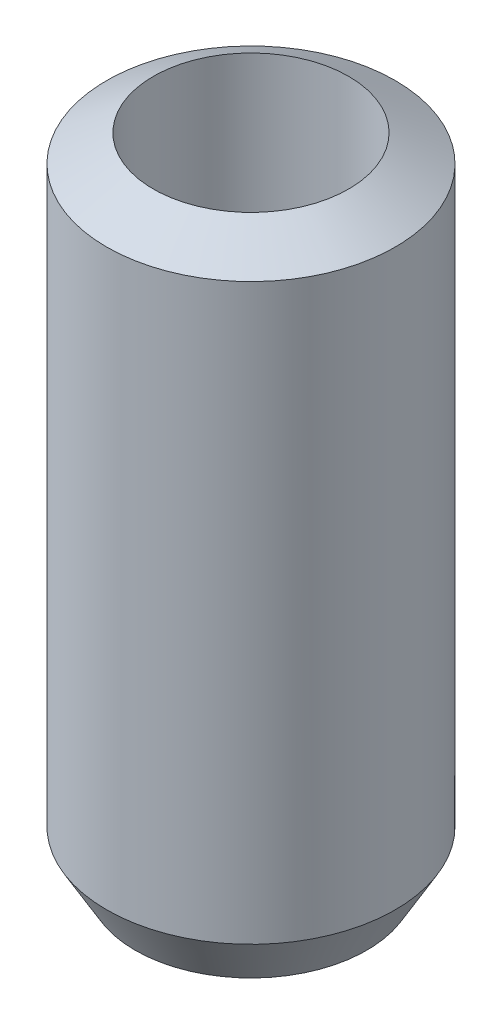
ISO-10303-21;
HEADER;
FILE_DESCRIPTION(('STEP AP214'),'2;1');
FILE_NAME('part.step','',(''),(''),'','','');
FILE_SCHEMA(('AUTOMOTIVE_DESIGN { 1 0 10303 214 1 1 1 1 }'));
ENDSEC;
DATA;
#1=APPLICATION_CONTEXT('core data for automotive mechanical design processes');
#2=APPLICATION_PROTOCOL_DEFINITION('international standard','automotive_design',2000,#1);
#3=PRODUCT_CONTEXT('',#1,'mechanical');
#4=PRODUCT('Part','Part','',(#3));
#5=PRODUCT_RELATED_PRODUCT_CATEGORY('part','',(#4));
#6=PRODUCT_DEFINITION_FORMATION('','',#4);
#7=PRODUCT_DEFINITION_CONTEXT('part definition',#1,'design');
#8=PRODUCT_DEFINITION('design','',#6,#7);
#9=PRODUCT_DEFINITION_SHAPE('','',#8);
#10=(LENGTH_UNIT() NAMED_UNIT(*) SI_UNIT(.MILLI.,.METRE.));
#11=(NAMED_UNIT(*) PLANE_ANGLE_UNIT() SI_UNIT($,.RADIAN.));
#12=(NAMED_UNIT(*) SI_UNIT($,.STERADIAN.) SOLID_ANGLE_UNIT());
#13=UNCERTAINTY_MEASURE_WITH_UNIT(LENGTH_MEASURE(1.E-05),#10,'distance_accuracy_value','');
#14=(GEOMETRIC_REPRESENTATION_CONTEXT(3) GLOBAL_UNCERTAINTY_ASSIGNED_CONTEXT((#13)) GLOBAL_UNIT_ASSIGNED_CONTEXT((#10,
#11,#12)) REPRESENTATION_CONTEXT('',''));
#15=CARTESIAN_POINT('',(0.,0.,0.));
#16=DIRECTION('',(0.,0.,1.));
#17=DIRECTION('',(1.,0.,0.));
#18=AXIS2_PLACEMENT_3D('',#15,#16,#17);
#19=CARTESIAN_POINT('',(0.,90.3380426375447,0.));
#20=DIRECTION('',(0.,-1.,0.));
#21=DIRECTION('',(0.,0.,-1.));
#22=AXIS2_PLACEMENT_3D('',#19,#20,#21);
#23=CYLINDRICAL_SURFACE('',#22,20.);
#24=CARTESIAN_POINT('',(0.,86.3935220367941,0.));
#25=DIRECTION('',(0.,1.,0.));
#26=DIRECTION('',(0.,0.,1.));
#27=AXIS2_PLACEMENT_3D('',#24,#25,#26);
#28=CIRCLE('',#27,20.);
#29=CARTESIAN_POINT('',(0.,86.3935220367941,20.));
#30=VERTEX_POINT('',#29);
#31=EDGE_CURVE('E50',#30,#30,#28,.F.);
#32=ORIENTED_EDGE('',*,*,#31,.T.);
#33=EDGE_LOOP('',(#32));
#34=FACE_BOUND('',#33,.T.);
#35=CARTESIAN_POINT('',(0.,6.83211009200205,0.));
#36=DIRECTION('',(0.,1.,0.));
#37=DIRECTION('',(0.,0.,1.));
#38=AXIS2_PLACEMENT_3D('',#35,#36,#37);
#39=CIRCLE('',#38,20.);
#40=CARTESIAN_POINT('',(0.,6.83211009200205,20.));
#41=VERTEX_POINT('',#40);
#42=EDGE_CURVE('E51',#41,#41,#39,.T.);
#43=ORIENTED_EDGE('',*,*,#42,.T.);
#44=EDGE_LOOP('',(#43));
#45=FACE_BOUND('',#44,.T.);
#46=ADVANCED_FACE('F39',(#34,#45),#23,.T.);
#47=CARTESIAN_POINT('',(0.,0.,0.));
#48=DIRECTION('',(0.,1.,0.));
#49=DIRECTION('',(0.,0.,1.));
#50=AXIS2_PLACEMENT_3D('',#47,#48,#49);
#51=PLANE('',#50);
#52=CARTESIAN_POINT('',(0.,0.,0.));
#53=DIRECTION('',(0.,1.,0.));
#54=DIRECTION('',(0.,0.,1.));
#55=AXIS2_PLACEMENT_3D('',#52,#53,#54);
#56=CIRCLE('',#55,16.0554793992494);
#57=CARTESIAN_POINT('',(0.,0.,16.0554793992494));
#58=VERTEX_POINT('',#57);
#59=EDGE_CURVE('E10',#58,#58,#56,.F.);
#60=ORIENTED_EDGE('',*,*,#59,.T.);
#61=EDGE_LOOP('',(#60));
#62=FACE_BOUND('',#61,.T.);
#63=CARTESIAN_POINT('',(0.,0.,0.));
#64=DIRECTION('',(0.,1.,0.));
#65=DIRECTION('',(0.,0.,1.));
#66=AXIS2_PLACEMENT_3D('',#63,#64,#65);
#67=CIRCLE('',#66,13.5388146388878);
#68=CARTESIAN_POINT('',(0.,0.,13.5388146388878));
#69=VERTEX_POINT('',#68);
#70=EDGE_CURVE('E58',#69,#69,#67,.T.);
#71=ORIENTED_EDGE('',*,*,#70,.T.);
#72=EDGE_LOOP('',(#71));
#73=FACE_BOUND('',#72,.T.);
#74=ADVANCED_FACE('F62',(#62,#73),#51,.F.);
#75=CARTESIAN_POINT('',(0.,90.3380426375447,0.));
#76=DIRECTION('',(0.,-1.,0.));
#77=DIRECTION('',(0.,0.,-1.));
#78=AXIS2_PLACEMENT_3D('',#75,#76,#77);
#79=CYLINDRICAL_SURFACE('',#78,13.5388146388878);
#80=CARTESIAN_POINT('',(0.,90.1238891443163,0.));
#81=DIRECTION('',(0.,-1.,0.));
#82=DIRECTION('',(0.,0.,-1.));
#83=AXIS2_PLACEMENT_3D('',#80,#81,#82);
#84=CIRCLE('',#83,13.5388146388878);
#85=CARTESIAN_POINT('',(0.,90.1238891443163,-13.5388146388878));
#86=VERTEX_POINT('',#85);
#87=EDGE_CURVE('E54',#86,#86,#84,.F.);
#88=ORIENTED_EDGE('',*,*,#87,.T.);
#89=EDGE_LOOP('',(#88));
#90=FACE_BOUND('',#89,.T.);
#91=ORIENTED_EDGE('',*,*,#70,.F.);
#92=EDGE_LOOP('',(#91));
#93=FACE_BOUND('',#92,.T.);
#94=ADVANCED_FACE('F68',(#90,#93),#79,.F.);
#95=CARTESIAN_POINT('',(0.,90.3380426375447,0.));
#96=DIRECTION('',(0.,-1.,0.));
#97=DIRECTION('',(0.,0.,-1.));
#98=AXIS2_PLACEMENT_3D('',#95,#96,#97);
#99=CONICAL_SURFACE('',#98,13.1678899079978,1.0471975511966);
#100=ORIENTED_EDGE('',*,*,#31,.F.);
#101=EDGE_LOOP('',(#100));
#102=FACE_BOUND('',#101,.T.);
#103=ORIENTED_EDGE('',*,*,#87,.F.);
#104=EDGE_LOOP('',(#103));
#105=FACE_BOUND('',#104,.T.);
#106=ADVANCED_FACE('F66',(#102,#105),#99,.T.);
#107=CARTESIAN_POINT('',(0.,6.83211009200205,0.));
#108=DIRECTION('',(0.,1.,0.));
#109=DIRECTION('',(0.,0.,1.));
#110=AXIS2_PLACEMENT_3D('',#107,#108,#109);
#111=CONICAL_SURFACE('',#110,20.,0.523598775598303);
#112=ORIENTED_EDGE('',*,*,#59,.F.);
#113=EDGE_LOOP('',(#112));
#114=FACE_BOUND('',#113,.T.);
#115=ORIENTED_EDGE('',*,*,#42,.F.);
#116=EDGE_LOOP('',(#115));
#117=FACE_BOUND('',#116,.T.);
#118=ADVANCED_FACE('F45',(#114,#117),#111,.T.);
#119=CLOSED_SHELL('',(#46,#74,#94,#106,#118));
#120=MANIFOLD_SOLID_BREP('B2',#119);
#121=ADVANCED_BREP_SHAPE_REPRESENTATION('',(#18,#120),#14);
#122=SHAPE_DEFINITION_REPRESENTATION(#9,#121);
ENDSEC;
END-ISO-10303-21;
